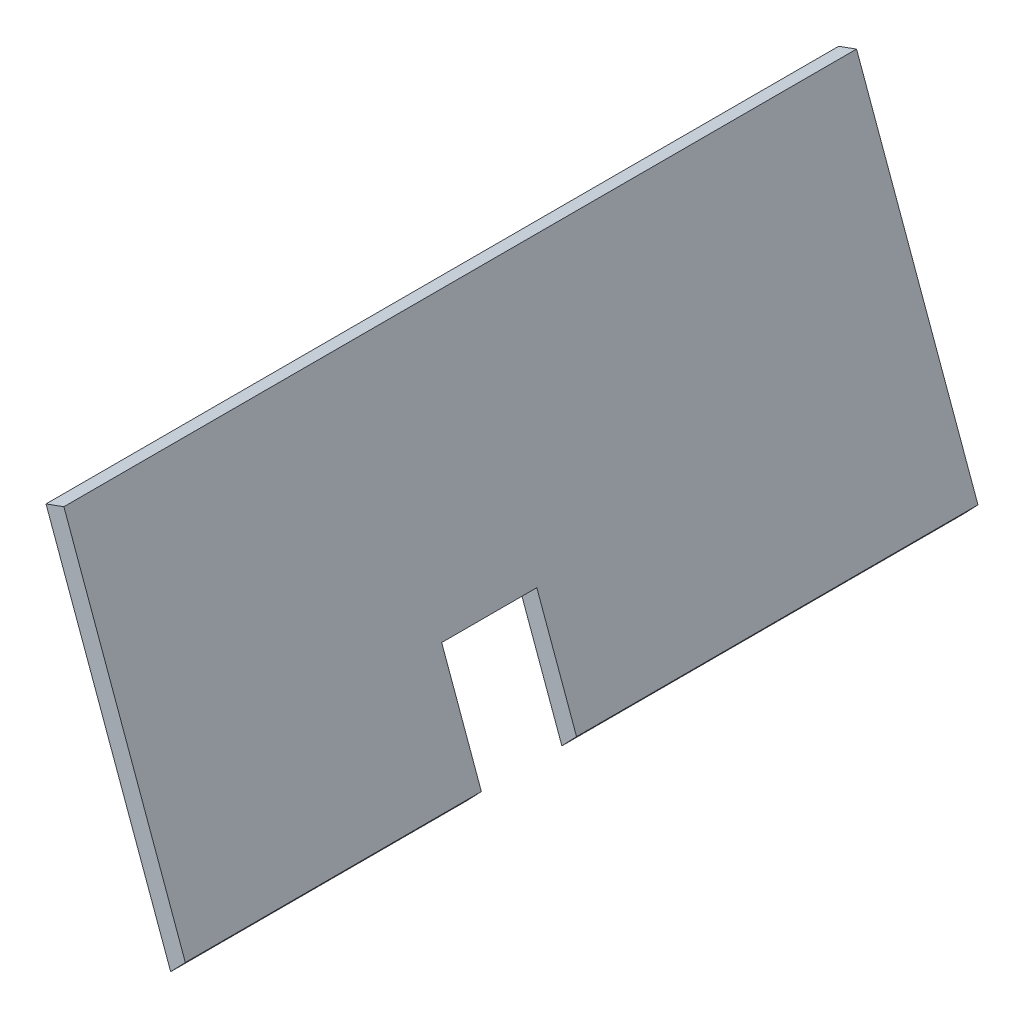
ISO-10303-21;
HEADER;
FILE_DESCRIPTION(('STEP AP214'),'2;1');
FILE_NAME('part.step','',(''),(''),'','','');
FILE_SCHEMA(('AUTOMOTIVE_DESIGN { 1 0 10303 214 1 1 1 1 }'));
ENDSEC;
DATA;
#1=APPLICATION_CONTEXT('core data for automotive mechanical design processes');
#2=APPLICATION_PROTOCOL_DEFINITION('international standard','automotive_design',2000,#1);
#3=PRODUCT_CONTEXT('',#1,'mechanical');
#4=PRODUCT('Part','Part','',(#3));
#5=PRODUCT_RELATED_PRODUCT_CATEGORY('part','',(#4));
#6=PRODUCT_DEFINITION_FORMATION('','',#4);
#7=PRODUCT_DEFINITION_CONTEXT('part definition',#1,'design');
#8=PRODUCT_DEFINITION('design','',#6,#7);
#9=PRODUCT_DEFINITION_SHAPE('','',#8);
#10=(LENGTH_UNIT() NAMED_UNIT(*) SI_UNIT(.MILLI.,.METRE.));
#11=(NAMED_UNIT(*) PLANE_ANGLE_UNIT() SI_UNIT($,.RADIAN.));
#12=(NAMED_UNIT(*) SI_UNIT($,.STERADIAN.) SOLID_ANGLE_UNIT());
#13=UNCERTAINTY_MEASURE_WITH_UNIT(LENGTH_MEASURE(1.E-05),#10,'distance_accuracy_value','');
#14=(GEOMETRIC_REPRESENTATION_CONTEXT(3) GLOBAL_UNCERTAINTY_ASSIGNED_CONTEXT((#13)) GLOBAL_UNIT_ASSIGNED_CONTEXT((#10,
#11,#12)) REPRESENTATION_CONTEXT('',''));
#15=CARTESIAN_POINT('',(0.,0.,0.));
#16=DIRECTION('',(0.,0.,1.));
#17=DIRECTION('',(1.,0.,0.));
#18=AXIS2_PLACEMENT_3D('',#15,#16,#17);
#19=CARTESIAN_POINT('',(3418.89008055072,-6658.76254263627,309.124557610643));
#20=DIRECTION('',(-0.722761597926758,0.691097440714665,0.));
#21=DIRECTION('',(-0.691097440714665,-0.722761597926758,0.));
#22=AXIS2_PLACEMENT_3D('',#19,#20,#21);
#23=PLANE('',#22);
#24=DIRECTION('',(0.,0.,-1.));
#25=VECTOR('',#24,1.);
#26=CARTESIAN_POINT('',(3422.7445182929,-6654.73150530705,309.124557610643));
#27=LINE('',#26,#25);
#28=CARTESIAN_POINT('',(3422.74451829367,-6654.73150530677,107.500000000015));
#29=VERTEX_POINT('',#28);
#30=CARTESIAN_POINT('',(3422.7445182929,-6654.73150530705,1.99999999999999));
#31=VERTEX_POINT('',#30);
#32=EDGE_CURVE('E150',#29,#31,#27,.T.);
#33=ORIENTED_EDGE('',*,*,#32,.F.);
#34=DIRECTION('',(-0.691097440714665,-0.722761597926758,0.));
#35=VECTOR('',#34,1.);
#36=CARTESIAN_POINT('',(3418.89008055072,-6658.76254263627,107.500000000015));
#37=LINE('',#36,#35);
#38=CARTESIAN_POINT('',(3418.89008055073,-6658.76254263627,107.500000000015));
#39=VERTEX_POINT('',#38);
#40=EDGE_CURVE('E125',#29,#39,#37,.T.);
#41=ORIENTED_EDGE('',*,*,#40,.T.);
#42=DIRECTION('',(0.,0.,-1.));
#43=VECTOR('',#42,1.);
#44=CARTESIAN_POINT('',(3418.89008055072,-6658.76254263627,309.124557610643));
#45=LINE('',#44,#43);
#46=CARTESIAN_POINT('',(3418.89008055072,-6658.76254263627,1.99999999999999));
#47=VERTEX_POINT('',#46);
#48=EDGE_CURVE('E152',#39,#47,#45,.T.);
#49=ORIENTED_EDGE('',*,*,#48,.T.);
#50=DIRECTION('',(0.691097440714665,0.722761597926758,0.));
#51=VECTOR('',#50,1.);
#52=CARTESIAN_POINT('',(3418.89008055072,-6658.76254263627,1.99999999999999));
#53=LINE('',#52,#51);
#54=EDGE_CURVE('E142',#47,#31,#53,.T.);
#55=ORIENTED_EDGE('',*,*,#54,.T.);
#56=EDGE_LOOP('',(#33,#41,#49,#55));
#57=FACE_BOUND('',#56,.T.);
#58=ADVANCED_FACE('F33',(#57),#23,.F.);
#59=CARTESIAN_POINT('',(3386.12933267783,-6568.6756751813,309.124557610643));
#60=DIRECTION('',(0.34176044904669,-0.939787101139085,0.));
#61=DIRECTION('',(0.939787101139085,0.34176044904669,0.));
#62=AXIS2_PLACEMENT_3D('',#59,#60,#61);
#63=PLANE('',#62);
#64=DIRECTION('',(-0.939787101139085,-0.34176044904669,0.));
#65=VECTOR('',#64,1.);
#66=CARTESIAN_POINT('',(3386.12933267783,-6568.6756751813,210.295833075035));
#67=LINE('',#66,#65);
#68=CARTESIAN_POINT('',(3390.82826818353,-6566.96687293606,210.295833075035));
#69=VERTEX_POINT('',#68);
#70=CARTESIAN_POINT('',(3386.12933267777,-6568.67567518132,210.295833075035));
#71=VERTEX_POINT('',#70);
#72=EDGE_CURVE('E56',#69,#71,#67,.T.);
#73=ORIENTED_EDGE('',*,*,#72,.F.);
#74=DIRECTION('',(0.,0.,-1.));
#75=VECTOR('',#74,1.);
#76=CARTESIAN_POINT('',(3390.82826818353,-6566.96687293606,309.124557610643));
#77=LINE('',#76,#75);
#78=CARTESIAN_POINT('',(3390.82826818353,-6566.96687293606,1.99999999999999));
#79=VERTEX_POINT('',#78);
#80=EDGE_CURVE('E148',#69,#79,#77,.T.);
#81=ORIENTED_EDGE('',*,*,#80,.T.);
#82=DIRECTION('',(-0.939787101139085,-0.34176044904669,0.));
#83=VECTOR('',#82,1.);
#84=CARTESIAN_POINT('',(3386.12933267783,-6568.6756751813,1.99999999999999));
#85=LINE('',#84,#83);
#86=CARTESIAN_POINT('',(3386.12933267783,-6568.6756751813,1.99999999999999));
#87=VERTEX_POINT('',#86);
#88=EDGE_CURVE('E131',#79,#87,#85,.T.);
#89=ORIENTED_EDGE('',*,*,#88,.T.);
#90=DIRECTION('',(0.,0.,-1.));
#91=VECTOR('',#90,1.);
#92=CARTESIAN_POINT('',(3386.12933267783,-6568.6756751813,309.124557610643));
#93=LINE('',#92,#91);
#94=EDGE_CURVE('E135',#71,#87,#93,.T.);
#95=ORIENTED_EDGE('',*,*,#94,.F.);
#96=EDGE_LOOP('',(#73,#81,#89,#95));
#97=FACE_BOUND('',#96,.T.);
#98=ADVANCED_FACE('F35',(#97),#63,.F.);
#99=CARTESIAN_POINT('',(3386.12933267783,-6568.6756751813,309.124557610643));
#100=DIRECTION('',(0.939787101139114,0.341760449046611,0.));
#101=DIRECTION('',(-0.341760449046611,0.939787101139114,0.));
#102=AXIS2_PLACEMENT_3D('',#99,#100,#101);
#103=PLANE('',#102);
#104=ORIENTED_EDGE('',*,*,#48,.F.);
#105=DIRECTION('',(-0.341760449046611,0.939787101139114,0.));
#106=VECTOR('',#105,1.);
#107=CARTESIAN_POINT('',(3386.12933267783,-6568.6756751813,107.500000000015));
#108=LINE('',#107,#106);
#109=CARTESIAN_POINT('',(3407.61198573219,-6627.74956829868,107.500000000015));
#110=VERTEX_POINT('',#109);
#111=EDGE_CURVE('E128',#39,#110,#108,.T.);
#112=ORIENTED_EDGE('',*,*,#111,.T.);
#113=DIRECTION('',(0.,0.,1.));
#114=VECTOR('',#113,1.);
#115=CARTESIAN_POINT('',(3407.61198573219,-6627.74956829868,309.124557610643));
#116=LINE('',#115,#114);
#117=CARTESIAN_POINT('',(3407.61198573219,-6627.74956829868,132.500000000015));
#118=VERTEX_POINT('',#117);
#119=EDGE_CURVE('E106',#110,#118,#116,.T.);
#120=ORIENTED_EDGE('',*,*,#119,.T.);
#121=DIRECTION('',(0.341760449046611,-0.939787101139114,0.));
#122=VECTOR('',#121,1.);
#123=CARTESIAN_POINT('',(3386.12933267783,-6568.6756751813,132.500000000015));
#124=LINE('',#123,#122);
#125=CARTESIAN_POINT('',(3418.89008055072,-6658.76254263627,132.500000000015));
#126=VERTEX_POINT('',#125);
#127=EDGE_CURVE('E104',#118,#126,#124,.T.);
#128=ORIENTED_EDGE('',*,*,#127,.T.);
#129=CARTESIAN_POINT('',(3418.89008055067,-6658.76254263632,210.295833075035));
#130=VERTEX_POINT('',#129);
#131=EDGE_CURVE('E153',#130,#126,#45,.T.);
#132=ORIENTED_EDGE('',*,*,#131,.F.);
#133=DIRECTION('',(0.341760449046611,-0.939787101139114,0.));
#134=VECTOR('',#133,1.);
#135=CARTESIAN_POINT('',(3386.12933267783,-6568.6756751813,210.295833075035));
#136=LINE('',#135,#134);
#137=EDGE_CURVE('E134',#71,#130,#136,.T.);
#138=ORIENTED_EDGE('',*,*,#137,.F.);
#139=ORIENTED_EDGE('',*,*,#94,.T.);
#140=DIRECTION('',(0.341760449046611,-0.939787101139114,0.));
#141=VECTOR('',#140,1.);
#142=CARTESIAN_POINT('',(3386.12933267783,-6568.6756751813,1.99999999999999));
#143=LINE('',#142,#141);
#144=EDGE_CURVE('E139',#87,#47,#143,.T.);
#145=ORIENTED_EDGE('',*,*,#144,.T.);
#146=EDGE_LOOP('',(#104,#112,#120,#128,#132,#138,#139,#145));
#147=FACE_BOUND('',#146,.T.);
#148=ADVANCED_FACE('F165',(#147),#103,.F.);
#149=ORIENTED_EDGE('',*,*,#131,.T.);
#150=DIRECTION('',(0.691097440714665,0.722761597926758,0.));
#151=VECTOR('',#150,1.);
#152=CARTESIAN_POINT('',(3418.89008055072,-6658.76254263627,132.500000000015));
#153=LINE('',#152,#151);
#154=CARTESIAN_POINT('',(3422.74451829367,-6654.73150530677,132.500000000015));
#155=VERTEX_POINT('',#154);
#156=EDGE_CURVE('E122',#126,#155,#153,.T.);
#157=ORIENTED_EDGE('',*,*,#156,.T.);
#158=CARTESIAN_POINT('',(3422.7445182929,-6654.73150530705,210.295833075035));
#159=VERTEX_POINT('',#158);
#160=EDGE_CURVE('E117',#159,#155,#27,.T.);
#161=ORIENTED_EDGE('',*,*,#160,.F.);
#162=DIRECTION('',(0.691097440714665,0.722761597926758,0.));
#163=VECTOR('',#162,1.);
#164=CARTESIAN_POINT('',(3418.89008055072,-6658.76254263627,210.295833075035));
#165=LINE('',#164,#163);
#166=EDGE_CURVE('E132',#130,#159,#165,.T.);
#167=ORIENTED_EDGE('',*,*,#166,.F.);
#168=EDGE_LOOP('',(#149,#157,#161,#167));
#169=FACE_BOUND('',#168,.T.);
#170=ADVANCED_FACE('F163',(#169),#23,.F.);
#171=CARTESIAN_POINT('',(3390.82826818353,-6566.96687293606,309.124557610643));
#172=DIRECTION('',(-0.939787101139113,-0.341760449046612,0.));
#173=DIRECTION('',(0.341760449046612,-0.939787101139113,0.));
#174=AXIS2_PLACEMENT_3D('',#171,#172,#173);
#175=PLANE('',#174);
#176=DIRECTION('',(0.,0.,1.));
#177=VECTOR('',#176,1.);
#178=CARTESIAN_POINT('',(3412.31092123865,-6626.04076605317,107.500000000015));
#179=LINE('',#178,#177);
#180=CARTESIAN_POINT('',(3412.31092123788,-6626.04076605344,107.500000000015));
#181=VERTEX_POINT('',#180);
#182=CARTESIAN_POINT('',(3412.31092123865,-6626.04076605317,132.500000000015));
#183=VERTEX_POINT('',#182);
#184=EDGE_CURVE('E109',#181,#183,#179,.T.);
#185=ORIENTED_EDGE('',*,*,#184,.F.);
#186=DIRECTION('',(0.341760449046612,-0.939787101139113,0.));
#187=VECTOR('',#186,1.);
#188=CARTESIAN_POINT('',(3390.82826818353,-6566.96687293606,107.500000000015));
#189=LINE('',#188,#187);
#190=EDGE_CURVE('E11',#181,#29,#189,.T.);
#191=ORIENTED_EDGE('',*,*,#190,.T.);
#192=ORIENTED_EDGE('',*,*,#32,.T.);
#193=DIRECTION('',(-0.341760449046612,0.939787101139113,0.));
#194=VECTOR('',#193,1.);
#195=CARTESIAN_POINT('',(3390.82826818353,-6566.96687293606,1.99999999999999));
#196=LINE('',#195,#194);
#197=EDGE_CURVE('E145',#31,#79,#196,.T.);
#198=ORIENTED_EDGE('',*,*,#197,.T.);
#199=ORIENTED_EDGE('',*,*,#80,.F.);
#200=DIRECTION('',(-0.341760449046612,0.939787101139113,0.));
#201=VECTOR('',#200,1.);
#202=CARTESIAN_POINT('',(3390.82826818353,-6566.96687293606,210.295833075035));
#203=LINE('',#202,#201);
#204=EDGE_CURVE('E41',#159,#69,#203,.T.);
#205=ORIENTED_EDGE('',*,*,#204,.F.);
#206=ORIENTED_EDGE('',*,*,#160,.T.);
#207=DIRECTION('',(0.341760449046718,-0.939787101139075,0.));
#208=VECTOR('',#207,1.);
#209=CARTESIAN_POINT('',(3412.31092123865,-6626.04076605317,132.500000000015));
#210=LINE('',#209,#208);
#211=EDGE_CURVE('E101',#183,#155,#210,.T.);
#212=ORIENTED_EDGE('',*,*,#211,.F.);
#213=EDGE_LOOP('',(#185,#191,#192,#198,#199,#205,#206,#212));
#214=FACE_BOUND('',#213,.T.);
#215=ADVANCED_FACE('F114',(#214),#175,.F.);
#216=CARTESIAN_POINT('',(0.,0.,1.99999999999999));
#217=DIRECTION('',(0.,0.,-1.));
#218=DIRECTION('',(-1.,0.,0.));
#219=AXIS2_PLACEMENT_3D('',#216,#217,#218);
#220=PLANE('',#219);
#221=ORIENTED_EDGE('',*,*,#88,.F.);
#222=ORIENTED_EDGE('',*,*,#197,.F.);
#223=ORIENTED_EDGE('',*,*,#54,.F.);
#224=ORIENTED_EDGE('',*,*,#144,.F.);
#225=EDGE_LOOP('',(#221,#222,#223,#224));
#226=FACE_BOUND('',#225,.T.);
#227=ADVANCED_FACE('F175',(#226),#220,.T.);
#228=CARTESIAN_POINT('',(3529.4488144161,-6621.89950588018,210.295833075035));
#229=DIRECTION('',(0.,0.,1.));
#230=DIRECTION('',(0.939787101139094,0.341760449046664,0.));
#231=AXIS2_PLACEMENT_3D('',#228,#229,#230);
#232=PLANE('',#231);
#233=ORIENTED_EDGE('',*,*,#72,.T.);
#234=ORIENTED_EDGE('',*,*,#137,.T.);
#235=ORIENTED_EDGE('',*,*,#166,.T.);
#236=ORIENTED_EDGE('',*,*,#204,.T.);
#237=EDGE_LOOP('',(#233,#234,#235,#236));
#238=FACE_BOUND('',#237,.T.);
#239=ADVANCED_FACE('F158',(#238),#232,.T.);
#240=CARTESIAN_POINT('',(3378.67769991141,-6638.27173284315,107.500000000015));
#241=DIRECTION('',(0.,0.,-1.));
#242=DIRECTION('',(-1.,0.,0.));
#243=AXIS2_PLACEMENT_3D('',#240,#241,#242);
#244=PLANE('',#243);
#245=ORIENTED_EDGE('',*,*,#40,.F.);
#246=ORIENTED_EDGE('',*,*,#190,.F.);
#247=DIRECTION('',(0.939787101139076,0.341760449046716,0.));
#248=VECTOR('',#247,1.);
#249=CARTESIAN_POINT('',(3378.67769991141,-6638.27173284315,107.500000000015));
#250=LINE('',#249,#248);
#251=EDGE_CURVE('E48',#110,#181,#250,.T.);
#252=ORIENTED_EDGE('',*,*,#251,.F.);
#253=ORIENTED_EDGE('',*,*,#111,.F.);
#254=EDGE_LOOP('',(#245,#246,#252,#253));
#255=FACE_BOUND('',#254,.T.);
#256=ADVANCED_FACE('F167',(#255),#244,.F.);
#257=CARTESIAN_POINT('',(3378.67769991141,-6638.27173284315,132.500000000015));
#258=DIRECTION('',(0.,0.,1.));
#259=DIRECTION('',(1.,0.,0.));
#260=AXIS2_PLACEMENT_3D('',#257,#258,#259);
#261=PLANE('',#260);
#262=DIRECTION('',(0.939787101139076,0.341760449046716,0.));
#263=VECTOR('',#262,1.);
#264=CARTESIAN_POINT('',(3378.67769991141,-6638.27173284315,132.500000000015));
#265=LINE('',#264,#263);
#266=EDGE_CURVE('E98',#118,#183,#265,.T.);
#267=ORIENTED_EDGE('',*,*,#266,.T.);
#268=ORIENTED_EDGE('',*,*,#211,.T.);
#269=ORIENTED_EDGE('',*,*,#156,.F.);
#270=ORIENTED_EDGE('',*,*,#127,.F.);
#271=EDGE_LOOP('',(#267,#268,#269,#270));
#272=FACE_BOUND('',#271,.T.);
#273=ADVANCED_FACE('F99',(#272),#261,.F.);
#274=CARTESIAN_POINT('',(3378.67769991141,-6638.27173284315,107.500000000015));
#275=DIRECTION('',(-0.341760449046716,0.939787101139076,0.));
#276=DIRECTION('',(-0.939787101139076,-0.341760449046716,0.));
#277=AXIS2_PLACEMENT_3D('',#274,#275,#276);
#278=PLANE('',#277);
#279=ORIENTED_EDGE('',*,*,#251,.T.);
#280=ORIENTED_EDGE('',*,*,#184,.T.);
#281=ORIENTED_EDGE('',*,*,#266,.F.);
#282=ORIENTED_EDGE('',*,*,#119,.F.);
#283=EDGE_LOOP('',(#279,#280,#281,#282));
#284=FACE_BOUND('',#283,.T.);
#285=ADVANCED_FACE('F110',(#284),#278,.F.);
#286=CLOSED_SHELL('',(#58,#98,#148,#170,#215,#227,#239,#256,#273,#285));
#287=MANIFOLD_SOLID_BREP('B2',#286);
#288=ADVANCED_BREP_SHAPE_REPRESENTATION('',(#18,#287),#14);
#289=SHAPE_DEFINITION_REPRESENTATION(#9,#288);
ENDSEC;
END-ISO-10303-21;
